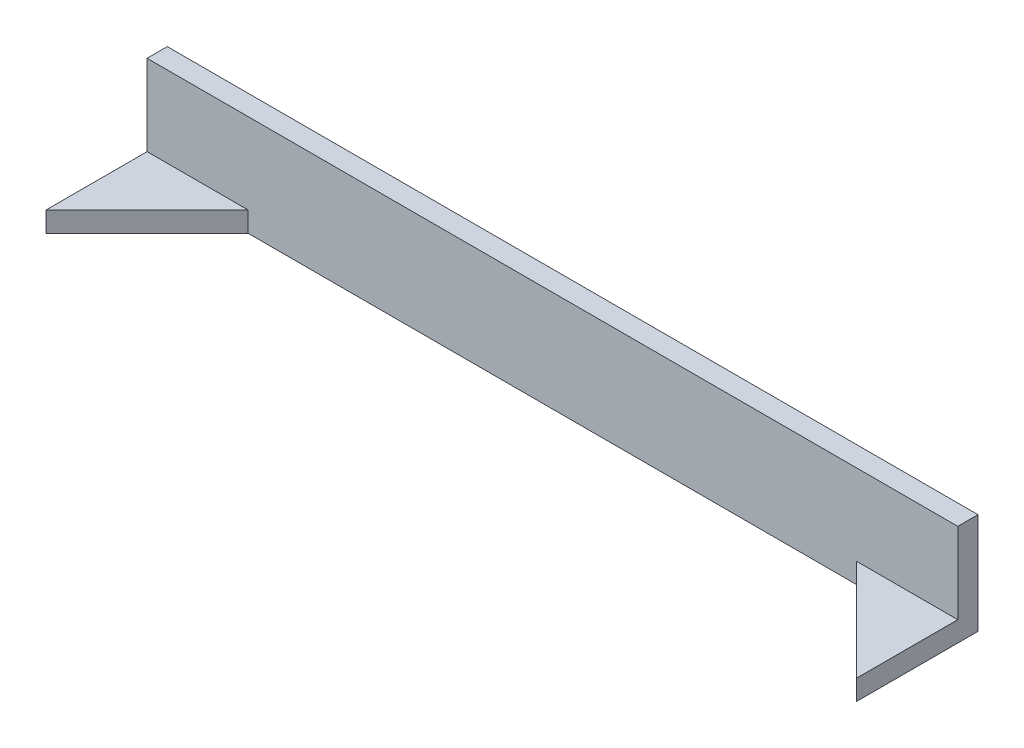
ISO-10303-21;
HEADER;
FILE_DESCRIPTION(('STEP AP214'),'2;1');
FILE_NAME('part.step','',(''),(''),'','','');
FILE_SCHEMA(('AUTOMOTIVE_DESIGN { 1 0 10303 214 1 1 1 1 }'));
ENDSEC;
DATA;
#1=APPLICATION_CONTEXT('core data for automotive mechanical design processes');
#2=APPLICATION_PROTOCOL_DEFINITION('international standard','automotive_design',2000,#1);
#3=PRODUCT_CONTEXT('',#1,'mechanical');
#4=PRODUCT('Part','Part','',(#3));
#5=PRODUCT_RELATED_PRODUCT_CATEGORY('part','',(#4));
#6=PRODUCT_DEFINITION_FORMATION('','',#4);
#7=PRODUCT_DEFINITION_CONTEXT('part definition',#1,'design');
#8=PRODUCT_DEFINITION('design','',#6,#7);
#9=PRODUCT_DEFINITION_SHAPE('','',#8);
#10=(LENGTH_UNIT() NAMED_UNIT(*) SI_UNIT(.MILLI.,.METRE.));
#11=(NAMED_UNIT(*) PLANE_ANGLE_UNIT() SI_UNIT($,.RADIAN.));
#12=(NAMED_UNIT(*) SI_UNIT($,.STERADIAN.) SOLID_ANGLE_UNIT());
#13=UNCERTAINTY_MEASURE_WITH_UNIT(LENGTH_MEASURE(1.E-05),#10,'distance_accuracy_value','');
#14=(GEOMETRIC_REPRESENTATION_CONTEXT(3) GLOBAL_UNCERTAINTY_ASSIGNED_CONTEXT((#13)) GLOBAL_UNIT_ASSIGNED_CONTEXT((#10,
#11,#12)) REPRESENTATION_CONTEXT('',''));
#15=CARTESIAN_POINT('',(0.,0.,0.));
#16=DIRECTION('',(0.,0.,1.));
#17=DIRECTION('',(1.,0.,0.));
#18=AXIS2_PLACEMENT_3D('',#15,#16,#17);
#19=CARTESIAN_POINT('',(1524.,95.,19.));
#20=DIRECTION('',(0.,0.,-1.));
#21=DIRECTION('',(0.,1.,0.));
#22=AXIS2_PLACEMENT_3D('',#19,#20,#21);
#23=PLANE('',#22);
#24=DIRECTION('',(-1.,0.,0.));
#25=VECTOR('',#24,1.);
#26=CARTESIAN_POINT('',(1524.,-57.,19.));
#27=LINE('',#26,#25);
#28=CARTESIAN_POINT('',(1524.,-57.,19.));
#29=VERTEX_POINT('',#28);
#30=CARTESIAN_POINT('',(1334.,-57.,19.));
#31=VERTEX_POINT('',#30);
#32=EDGE_CURVE('E122',#29,#31,#27,.T.);
#33=ORIENTED_EDGE('',*,*,#32,.F.);
#34=DIRECTION('',(0.,-1.,0.));
#35=VECTOR('',#34,1.);
#36=CARTESIAN_POINT('',(1524.,95.,19.));
#37=LINE('',#36,#35);
#38=CARTESIAN_POINT('',(1524.,95.,19.));
#39=VERTEX_POINT('',#38);
#40=EDGE_CURVE('E142',#39,#29,#37,.T.);
#41=ORIENTED_EDGE('',*,*,#40,.F.);
#42=DIRECTION('',(-1.,0.,0.));
#43=VECTOR('',#42,1.);
#44=CARTESIAN_POINT('',(1524.,95.,19.));
#45=LINE('',#44,#43);
#46=CARTESIAN_POINT('',(0.,95.,19.));
#47=VERTEX_POINT('',#46);
#48=EDGE_CURVE('E45',#39,#47,#45,.T.);
#49=ORIENTED_EDGE('',*,*,#48,.T.);
#50=DIRECTION('',(0.,-1.,0.));
#51=VECTOR('',#50,1.);
#52=CARTESIAN_POINT('',(0.,95.,19.));
#53=LINE('',#52,#51);
#54=CARTESIAN_POINT('',(0.,-57.,19.));
#55=VERTEX_POINT('',#54);
#56=EDGE_CURVE('E52',#47,#55,#53,.T.);
#57=ORIENTED_EDGE('',*,*,#56,.T.);
#58=DIRECTION('',(-1.,0.,0.));
#59=VECTOR('',#58,1.);
#60=CARTESIAN_POINT('',(0.,-57.,19.));
#61=LINE('',#60,#59);
#62=CARTESIAN_POINT('',(190.,-57.,19.));
#63=VERTEX_POINT('',#62);
#64=EDGE_CURVE('E121',#63,#55,#61,.T.);
#65=ORIENTED_EDGE('',*,*,#64,.F.);
#66=DIRECTION('',(0.,1.,0.));
#67=VECTOR('',#66,1.);
#68=CARTESIAN_POINT('',(190.,-95.,19.));
#69=LINE('',#68,#67);
#70=CARTESIAN_POINT('',(190.,-95.,19.));
#71=VERTEX_POINT('',#70);
#72=EDGE_CURVE('E113',#71,#63,#69,.T.);
#73=ORIENTED_EDGE('',*,*,#72,.F.);
#74=DIRECTION('',(-1.,0.,0.));
#75=VECTOR('',#74,1.);
#76=CARTESIAN_POINT('',(1524.,-95.,19.));
#77=LINE('',#76,#75);
#78=CARTESIAN_POINT('',(1334.,-95.,19.));
#79=VERTEX_POINT('',#78);
#80=EDGE_CURVE('E154',#79,#71,#77,.T.);
#81=ORIENTED_EDGE('',*,*,#80,.F.);
#82=DIRECTION('',(0.,-1.,0.));
#83=VECTOR('',#82,1.);
#84=CARTESIAN_POINT('',(1334.,-95.,19.));
#85=LINE('',#84,#83);
#86=EDGE_CURVE('E168',#31,#79,#85,.T.);
#87=ORIENTED_EDGE('',*,*,#86,.F.);
#88=EDGE_LOOP('',(#33,#41,#49,#57,#65,#73,#81,#87));
#89=FACE_BOUND('',#88,.T.);
#90=ADVANCED_FACE('F37',(#89),#23,.F.);
#91=CARTESIAN_POINT('',(1524.,95.,-19.));
#92=DIRECTION('',(0.,0.,1.));
#93=DIRECTION('',(0.,-1.,0.));
#94=AXIS2_PLACEMENT_3D('',#91,#92,#93);
#95=PLANE('',#94);
#96=DIRECTION('',(0.,1.,0.));
#97=VECTOR('',#96,1.);
#98=CARTESIAN_POINT('',(0.,95.,-19.));
#99=LINE('',#98,#97);
#100=CARTESIAN_POINT('',(0.,-95.,-19.));
#101=VERTEX_POINT('',#100);
#102=CARTESIAN_POINT('',(0.,95.,-19.));
#103=VERTEX_POINT('',#102);
#104=EDGE_CURVE('E138',#101,#103,#99,.T.);
#105=ORIENTED_EDGE('',*,*,#104,.T.);
#106=DIRECTION('',(-1.,0.,0.));
#107=VECTOR('',#106,1.);
#108=CARTESIAN_POINT('',(1524.,95.,-19.));
#109=LINE('',#108,#107);
#110=CARTESIAN_POINT('',(1524.,95.,-19.));
#111=VERTEX_POINT('',#110);
#112=EDGE_CURVE('E11',#111,#103,#109,.T.);
#113=ORIENTED_EDGE('',*,*,#112,.F.);
#114=DIRECTION('',(0.,1.,0.));
#115=VECTOR('',#114,1.);
#116=CARTESIAN_POINT('',(1524.,95.,-19.));
#117=LINE('',#116,#115);
#118=CARTESIAN_POINT('',(1524.,-95.,-19.));
#119=VERTEX_POINT('',#118);
#120=EDGE_CURVE('E139',#119,#111,#117,.T.);
#121=ORIENTED_EDGE('',*,*,#120,.F.);
#122=DIRECTION('',(-1.,0.,0.));
#123=VECTOR('',#122,1.);
#124=CARTESIAN_POINT('',(1524.,-95.,-19.));
#125=LINE('',#124,#123);
#126=EDGE_CURVE('E146',#119,#101,#125,.T.);
#127=ORIENTED_EDGE('',*,*,#126,.T.);
#128=EDGE_LOOP('',(#105,#113,#121,#127));
#129=FACE_BOUND('',#128,.T.);
#130=ADVANCED_FACE('F39',(#129),#95,.F.);
#131=CARTESIAN_POINT('',(1524.,95.,19.));
#132=DIRECTION('',(0.,-1.,0.));
#133=DIRECTION('',(0.,0.,-1.));
#134=AXIS2_PLACEMENT_3D('',#131,#132,#133);
#135=PLANE('',#134);
#136=DIRECTION('',(0.,0.,1.));
#137=VECTOR('',#136,1.);
#138=CARTESIAN_POINT('',(0.,95.,19.));
#139=LINE('',#138,#137);
#140=EDGE_CURVE('E149',#103,#47,#139,.T.);
#141=ORIENTED_EDGE('',*,*,#140,.T.);
#142=ORIENTED_EDGE('',*,*,#48,.F.);
#143=DIRECTION('',(0.,0.,1.));
#144=VECTOR('',#143,1.);
#145=CARTESIAN_POINT('',(1524.,95.,19.));
#146=LINE('',#145,#144);
#147=EDGE_CURVE('E84',#111,#39,#146,.T.);
#148=ORIENTED_EDGE('',*,*,#147,.F.);
#149=ORIENTED_EDGE('',*,*,#112,.T.);
#150=EDGE_LOOP('',(#141,#142,#148,#149));
#151=FACE_BOUND('',#150,.T.);
#152=ADVANCED_FACE('F183',(#151),#135,.F.);
#153=CARTESIAN_POINT('',(1524.,-95.,19.));
#154=DIRECTION('',(0.,1.,0.));
#155=DIRECTION('',(0.,0.,1.));
#156=AXIS2_PLACEMENT_3D('',#153,#154,#155);
#157=PLANE('',#156);
#158=ORIENTED_EDGE('',*,*,#80,.T.);
#159=DIRECTION('',(-0.707106781186548,0.,0.707106781186548));
#160=VECTOR('',#159,1.);
#161=CARTESIAN_POINT('',(857.,-95.,-648.));
#162=LINE('',#161,#160);
#163=CARTESIAN_POINT('',(0.,-95.,209.));
#164=VERTEX_POINT('',#163);
#165=EDGE_CURVE('E118',#71,#164,#162,.T.);
#166=ORIENTED_EDGE('',*,*,#165,.T.);
#167=DIRECTION('',(0.,0.,-1.));
#168=VECTOR('',#167,1.);
#169=CARTESIAN_POINT('',(0.,-95.,19.));
#170=LINE('',#169,#168);
#171=EDGE_CURVE('E79',#164,#101,#170,.T.);
#172=ORIENTED_EDGE('',*,*,#171,.T.);
#173=ORIENTED_EDGE('',*,*,#126,.F.);
#174=DIRECTION('',(0.,0.,-1.));
#175=VECTOR('',#174,1.);
#176=CARTESIAN_POINT('',(1524.,-95.,19.));
#177=LINE('',#176,#175);
#178=CARTESIAN_POINT('',(1524.,-95.,209.));
#179=VERTEX_POINT('',#178);
#180=EDGE_CURVE('E61',#179,#119,#177,.T.);
#181=ORIENTED_EDGE('',*,*,#180,.F.);
#182=DIRECTION('',(-0.707106781186547,0.,-0.707106781186548));
#183=VECTOR('',#182,1.);
#184=CARTESIAN_POINT('',(1429.,-95.,114.));
#185=LINE('',#184,#183);
#186=EDGE_CURVE('E129',#179,#79,#185,.T.);
#187=ORIENTED_EDGE('',*,*,#186,.T.);
#188=EDGE_LOOP('',(#158,#166,#172,#173,#181,#187));
#189=FACE_BOUND('',#188,.T.);
#190=ADVANCED_FACE('F159',(#189),#157,.F.);
#191=CARTESIAN_POINT('',(1524.,0.,0.));
#192=DIRECTION('',(1.,0.,0.));
#193=DIRECTION('',(0.,0.,-1.));
#194=AXIS2_PLACEMENT_3D('',#191,#192,#193);
#195=PLANE('',#194);
#196=ORIENTED_EDGE('',*,*,#120,.T.);
#197=ORIENTED_EDGE('',*,*,#147,.T.);
#198=ORIENTED_EDGE('',*,*,#40,.T.);
#199=DIRECTION('',(0.,0.,-1.));
#200=VECTOR('',#199,1.);
#201=CARTESIAN_POINT('',(1524.,-57.,209.));
#202=LINE('',#201,#200);
#203=CARTESIAN_POINT('',(1524.,-57.,209.));
#204=VERTEX_POINT('',#203);
#205=EDGE_CURVE('E161',#204,#29,#202,.T.);
#206=ORIENTED_EDGE('',*,*,#205,.F.);
#207=DIRECTION('',(0.,1.,0.));
#208=VECTOR('',#207,1.);
#209=CARTESIAN_POINT('',(1524.,-95.,209.));
#210=LINE('',#209,#208);
#211=EDGE_CURVE('E163',#179,#204,#210,.T.);
#212=ORIENTED_EDGE('',*,*,#211,.F.);
#213=ORIENTED_EDGE('',*,*,#180,.T.);
#214=EDGE_LOOP('',(#196,#197,#198,#206,#212,#213));
#215=FACE_BOUND('',#214,.T.);
#216=ADVANCED_FACE('F179',(#215),#195,.T.);
#217=CARTESIAN_POINT('',(0.,0.,0.));
#218=DIRECTION('',(1.,0.,0.));
#219=DIRECTION('',(0.,0.,-1.));
#220=AXIS2_PLACEMENT_3D('',#217,#218,#219);
#221=PLANE('',#220);
#222=ORIENTED_EDGE('',*,*,#104,.F.);
#223=ORIENTED_EDGE('',*,*,#171,.F.);
#224=DIRECTION('',(0.,-1.,0.));
#225=VECTOR('',#224,1.);
#226=CARTESIAN_POINT('',(0.,-95.,209.));
#227=LINE('',#226,#225);
#228=CARTESIAN_POINT('',(0.,-57.,209.));
#229=VERTEX_POINT('',#228);
#230=EDGE_CURVE('E133',#229,#164,#227,.T.);
#231=ORIENTED_EDGE('',*,*,#230,.F.);
#232=DIRECTION('',(0.,0.,-1.));
#233=VECTOR('',#232,1.);
#234=CARTESIAN_POINT('',(0.,-57.,209.));
#235=LINE('',#234,#233);
#236=EDGE_CURVE('E127',#229,#55,#235,.T.);
#237=ORIENTED_EDGE('',*,*,#236,.T.);
#238=ORIENTED_EDGE('',*,*,#56,.F.);
#239=ORIENTED_EDGE('',*,*,#140,.F.);
#240=EDGE_LOOP('',(#222,#223,#231,#237,#238,#239));
#241=FACE_BOUND('',#240,.T.);
#242=ADVANCED_FACE('F158',(#241),#221,.F.);
#243=CARTESIAN_POINT('',(0.,-57.,209.));
#244=DIRECTION('',(0.,-1.,0.));
#245=DIRECTION('',(0.,0.,-1.));
#246=AXIS2_PLACEMENT_3D('',#243,#244,#245);
#247=PLANE('',#246);
#248=ORIENTED_EDGE('',*,*,#236,.F.);
#249=DIRECTION('',(-0.707106781186548,0.,0.707106781186548));
#250=VECTOR('',#249,1.);
#251=CARTESIAN_POINT('',(190.,-57.,19.));
#252=LINE('',#251,#250);
#253=EDGE_CURVE('E116',#63,#229,#252,.T.);
#254=ORIENTED_EDGE('',*,*,#253,.F.);
#255=ORIENTED_EDGE('',*,*,#64,.T.);
#256=EDGE_LOOP('',(#248,#254,#255));
#257=FACE_BOUND('',#256,.T.);
#258=ADVANCED_FACE('F125',(#257),#247,.F.);
#259=CARTESIAN_POINT('',(1524.,-57.,209.));
#260=DIRECTION('',(0.,-1.,0.));
#261=DIRECTION('',(0.,0.,-1.));
#262=AXIS2_PLACEMENT_3D('',#259,#260,#261);
#263=PLANE('',#262);
#264=ORIENTED_EDGE('',*,*,#32,.T.);
#265=DIRECTION('',(-0.707106781186547,0.,-0.707106781186548));
#266=VECTOR('',#265,1.);
#267=CARTESIAN_POINT('',(1334.,-57.,19.));
#268=LINE('',#267,#266);
#269=EDGE_CURVE('E130',#204,#31,#268,.T.);
#270=ORIENTED_EDGE('',*,*,#269,.F.);
#271=ORIENTED_EDGE('',*,*,#205,.T.);
#272=EDGE_LOOP('',(#264,#270,#271));
#273=FACE_BOUND('',#272,.T.);
#274=ADVANCED_FACE('F177',(#273),#263,.F.);
#275=CARTESIAN_POINT('',(1334.,-247.,19.));
#276=DIRECTION('',(0.707106781186548,0.,-0.707106781186547));
#277=DIRECTION('',(-0.707106781186547,0.,-0.707106781186548));
#278=AXIS2_PLACEMENT_3D('',#275,#276,#277);
#279=PLANE('',#278);
#280=ORIENTED_EDGE('',*,*,#211,.T.);
#281=ORIENTED_EDGE('',*,*,#269,.T.);
#282=ORIENTED_EDGE('',*,*,#86,.T.);
#283=ORIENTED_EDGE('',*,*,#186,.F.);
#284=EDGE_LOOP('',(#280,#281,#282,#283));
#285=FACE_BOUND('',#284,.T.);
#286=ADVANCED_FACE('F174',(#285),#279,.F.);
#287=CARTESIAN_POINT('',(190.,-247.,19.));
#288=DIRECTION('',(-0.707106781186548,0.,-0.707106781186548));
#289=DIRECTION('',(-0.707106781186548,0.,0.707106781186548));
#290=AXIS2_PLACEMENT_3D('',#287,#288,#289);
#291=PLANE('',#290);
#292=ORIENTED_EDGE('',*,*,#72,.T.);
#293=ORIENTED_EDGE('',*,*,#253,.T.);
#294=ORIENTED_EDGE('',*,*,#230,.T.);
#295=ORIENTED_EDGE('',*,*,#165,.F.);
#296=EDGE_LOOP('',(#292,#293,#294,#295));
#297=FACE_BOUND('',#296,.T.);
#298=ADVANCED_FACE('F115',(#297),#291,.F.);
#299=CLOSED_SHELL('',(#90,#130,#152,#190,#216,#242,#258,#274,#286,#298));
#300=MANIFOLD_SOLID_BREP('B2',#299);
#301=ADVANCED_BREP_SHAPE_REPRESENTATION('',(#18,#300),#14);
#302=SHAPE_DEFINITION_REPRESENTATION(#9,#301);
ENDSEC;
END-ISO-10303-21;
